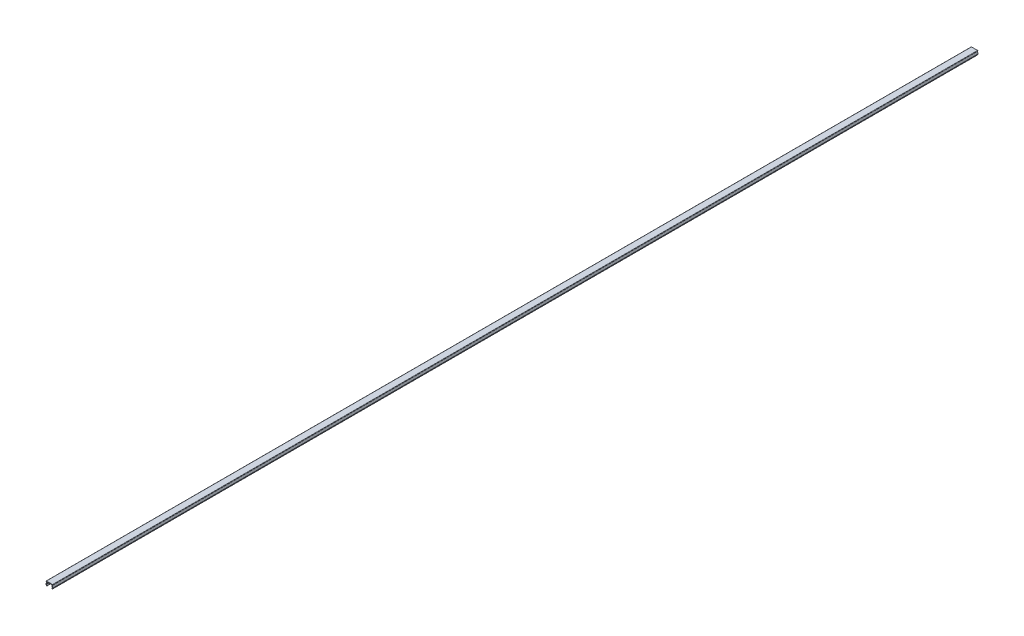
ISO-10303-21;
HEADER;
FILE_DESCRIPTION(('STEP AP214'),'2;1');
FILE_NAME('part.step','',(''),(''),'','','');
FILE_SCHEMA(('AUTOMOTIVE_DESIGN { 1 0 10303 214 1 1 1 1 }'));
ENDSEC;
DATA;
#1=APPLICATION_CONTEXT('core data for automotive mechanical design processes');
#2=APPLICATION_PROTOCOL_DEFINITION('international standard','automotive_design',2000,#1);
#3=PRODUCT_CONTEXT('',#1,'mechanical');
#4=PRODUCT('Part','Part','',(#3));
#5=PRODUCT_RELATED_PRODUCT_CATEGORY('part','',(#4));
#6=PRODUCT_DEFINITION_FORMATION('','',#4);
#7=PRODUCT_DEFINITION_CONTEXT('part definition',#1,'design');
#8=PRODUCT_DEFINITION('design','',#6,#7);
#9=PRODUCT_DEFINITION_SHAPE('','',#8);
#10=(LENGTH_UNIT() NAMED_UNIT(*) SI_UNIT(.MILLI.,.METRE.));
#11=(NAMED_UNIT(*) PLANE_ANGLE_UNIT() SI_UNIT($,.RADIAN.));
#12=(NAMED_UNIT(*) SI_UNIT($,.STERADIAN.) SOLID_ANGLE_UNIT());
#13=UNCERTAINTY_MEASURE_WITH_UNIT(LENGTH_MEASURE(1.E-05),#10,'distance_accuracy_value','');
#14=(GEOMETRIC_REPRESENTATION_CONTEXT(3) GLOBAL_UNCERTAINTY_ASSIGNED_CONTEXT((#13)) GLOBAL_UNIT_ASSIGNED_CONTEXT((#10,
#11,#12)) REPRESENTATION_CONTEXT('',''));
#15=CARTESIAN_POINT('',(0.,0.,0.));
#16=DIRECTION('',(0.,0.,1.));
#17=DIRECTION('',(1.,0.,0.));
#18=AXIS2_PLACEMENT_3D('',#15,#16,#17);
#19=CARTESIAN_POINT('',(-1.32833862518597,3.94999984480356,1000.));
#20=DIRECTION('',(0.,1.,0.));
#21=DIRECTION('',(0.,0.,1.));
#22=AXIS2_PLACEMENT_3D('',#19,#20,#21);
#23=PLANE('',#22);
#24=DIRECTION('',(0.,0.,-1.));
#25=VECTOR('',#24,1.);
#26=CARTESIAN_POINT('',(4.82913663774382,3.94999984480356,1000.));
#27=LINE('',#26,#25);
#28=CARTESIAN_POINT('',(4.82913663774382,3.94999984480356,1000.));
#29=VERTEX_POINT('',#28);
#30=CARTESIAN_POINT('',(4.82913663774382,3.94999984480356,0.));
#31=VERTEX_POINT('',#30);
#32=EDGE_CURVE('E162',#29,#31,#27,.T.);
#33=ORIENTED_EDGE('',*,*,#32,.F.);
#34=DIRECTION('',(1.,0.,0.));
#35=VECTOR('',#34,1.);
#36=CARTESIAN_POINT('',(-1.32833862518597,3.94999984480356,1000.));
#37=LINE('',#36,#35);
#38=CARTESIAN_POINT('',(-0.285813888115763,3.94999984480356,1000.));
#39=VERTEX_POINT('',#38);
#40=EDGE_CURVE('E232',#39,#29,#37,.T.);
#41=ORIENTED_EDGE('',*,*,#40,.F.);
#42=DIRECTION('',(0.,0.,-1.));
#43=VECTOR('',#42,1.);
#44=CARTESIAN_POINT('',(-0.285813888115763,3.94999984480356,1000.));
#45=LINE('',#44,#43);
#46=CARTESIAN_POINT('',(-0.285813888115763,3.94999984480356,0.));
#47=VERTEX_POINT('',#46);
#48=EDGE_CURVE('E245',#39,#47,#45,.T.);
#49=ORIENTED_EDGE('',*,*,#48,.T.);
#50=DIRECTION('',(1.,0.,0.));
#51=VECTOR('',#50,1.);
#52=CARTESIAN_POINT('',(-1.32833862518597,3.94999984480356,0.));
#53=LINE('',#52,#51);
#54=EDGE_CURVE('E240',#47,#31,#53,.T.);
#55=ORIENTED_EDGE('',*,*,#54,.T.);
#56=EDGE_LOOP('',(#33,#41,#49,#55));
#57=FACE_BOUND('',#56,.T.);
#58=ADVANCED_FACE('F16',(#57),#23,.F.);
#59=CARTESIAN_POINT('',(-1.02833862518597,3.94999984480356,1000.));
#60=VERTEX_POINT('',#59);
#61=CARTESIAN_POINT('',(-0.899434790827606,3.94999984480356,1000.));
#62=VERTEX_POINT('',#61);
#63=EDGE_CURVE('E229',#60,#62,#37,.T.);
#64=ORIENTED_EDGE('',*,*,#63,.F.);
#65=DIRECTION('',(0.,0.,-1.));
#66=VECTOR('',#65,1.);
#67=CARTESIAN_POINT('',(-1.02833862518597,3.94999984480356,0.));
#68=LINE('',#67,#66);
#69=CARTESIAN_POINT('',(-1.02833862518597,3.94999984480356,0.));
#70=VERTEX_POINT('',#69);
#71=EDGE_CURVE('E25',#60,#70,#68,.T.);
#72=ORIENTED_EDGE('',*,*,#71,.T.);
#73=CARTESIAN_POINT('',(-0.899434790827606,3.94999984480356,0.));
#74=VERTEX_POINT('',#73);
#75=EDGE_CURVE('E237',#70,#74,#53,.T.);
#76=ORIENTED_EDGE('',*,*,#75,.T.);
#77=DIRECTION('',(0.,0.,-1.));
#78=VECTOR('',#77,1.);
#79=CARTESIAN_POINT('',(-0.899434790827606,3.94999984480356,1000.));
#80=LINE('',#79,#78);
#81=EDGE_CURVE('E236',#62,#74,#80,.T.);
#82=ORIENTED_EDGE('',*,*,#81,.F.);
#83=EDGE_LOOP('',(#64,#72,#76,#82));
#84=FACE_BOUND('',#83,.T.);
#85=ADVANCED_FACE('F318',(#84),#23,.F.);
#86=CARTESIAN_POINT('',(5.44275754045566,3.94999984480356,0.));
#87=VERTEX_POINT('',#86);
#88=CARTESIAN_POINT('',(5.57166137481403,3.94999984480356,0.));
#89=VERTEX_POINT('',#88);
#90=EDGE_CURVE('E228',#87,#89,#53,.T.);
#91=ORIENTED_EDGE('',*,*,#90,.T.);
#92=DIRECTION('',(0.,0.,-1.));
#93=VECTOR('',#92,1.);
#94=CARTESIAN_POINT('',(5.57166137481403,3.94999984480356,1000.));
#95=LINE('',#94,#93);
#96=CARTESIAN_POINT('',(5.57166137481403,3.94999984480356,1000.));
#97=VERTEX_POINT('',#96);
#98=EDGE_CURVE('E10',#89,#97,#95,.F.);
#99=ORIENTED_EDGE('',*,*,#98,.T.);
#100=CARTESIAN_POINT('',(5.44275754045566,3.94999984480356,1000.));
#101=VERTEX_POINT('',#100);
#102=EDGE_CURVE('E233',#101,#97,#37,.T.);
#103=ORIENTED_EDGE('',*,*,#102,.F.);
#104=DIRECTION('',(0.,0.,-1.));
#105=VECTOR('',#104,1.);
#106=CARTESIAN_POINT('',(5.44275754045567,3.94999984480356,1000.));
#107=LINE('',#106,#105);
#108=EDGE_CURVE('E191',#101,#87,#107,.T.);
#109=ORIENTED_EDGE('',*,*,#108,.T.);
#110=EDGE_LOOP('',(#91,#99,#103,#109));
#111=FACE_BOUND('',#110,.T.);
#112=ADVANCED_FACE('F287',(#111),#23,.F.);
#113=CARTESIAN_POINT('',(-1.32833862518597,4.54999984480356,1000.));
#114=DIRECTION('',(0.,1.,0.));
#115=DIRECTION('',(0.,0.,1.));
#116=AXIS2_PLACEMENT_3D('',#113,#114,#115);
#117=PLANE('',#116);
#118=DIRECTION('',(1.,0.,0.));
#119=VECTOR('',#118,1.);
#120=CARTESIAN_POINT('',(-1.32833862518597,4.54999984480356,0.));
#121=LINE('',#120,#119);
#122=CARTESIAN_POINT('',(-1.02833862518597,4.54999984480356,0.));
#123=VERTEX_POINT('',#122);
#124=CARTESIAN_POINT('',(5.57166137481403,4.54999984480356,0.));
#125=VERTEX_POINT('',#124);
#126=EDGE_CURVE('E239',#123,#125,#121,.T.);
#127=ORIENTED_EDGE('',*,*,#126,.F.);
#128=DIRECTION('',(0.,0.,-1.));
#129=VECTOR('',#128,1.);
#130=CARTESIAN_POINT('',(-1.02833862518597,4.54999984480356,1000.));
#131=LINE('',#130,#129);
#132=CARTESIAN_POINT('',(-1.02833862518597,4.54999984480356,1000.));
#133=VERTEX_POINT('',#132);
#134=EDGE_CURVE('E258',#123,#133,#131,.F.);
#135=ORIENTED_EDGE('',*,*,#134,.T.);
#136=DIRECTION('',(1.,0.,0.));
#137=VECTOR('',#136,1.);
#138=CARTESIAN_POINT('',(-1.32833862518597,4.54999984480356,1000.));
#139=LINE('',#138,#137);
#140=CARTESIAN_POINT('',(5.57166137481403,4.54999984480356,1000.));
#141=VERTEX_POINT('',#140);
#142=EDGE_CURVE('E231',#133,#141,#139,.T.);
#143=ORIENTED_EDGE('',*,*,#142,.T.);
#144=DIRECTION('',(0.,0.,-1.));
#145=VECTOR('',#144,1.);
#146=CARTESIAN_POINT('',(5.57166137481403,4.54999984480356,1000.));
#147=LINE('',#146,#145);
#148=EDGE_CURVE('E255',#141,#125,#147,.T.);
#149=ORIENTED_EDGE('',*,*,#148,.T.);
#150=EDGE_LOOP('',(#127,#135,#143,#149));
#151=FACE_BOUND('',#150,.T.);
#152=ADVANCED_FACE('F327',(#151),#117,.T.);
#153=CARTESIAN_POINT('',(0.,0.,1000.));
#154=DIRECTION('',(0.,0.,-1.));
#155=DIRECTION('',(-1.,0.,0.));
#156=AXIS2_PLACEMENT_3D('',#153,#154,#155);
#157=PLANE('',#156);
#158=ORIENTED_EDGE('',*,*,#142,.F.);
#159=CARTESIAN_POINT('',(-1.02833862518597,4.24999984480356,1000.));
#160=DIRECTION('',(0.,0.,-1.));
#161=DIRECTION('',(-1.,0.,0.));
#162=AXIS2_PLACEMENT_3D('',#159,#160,#161);
#163=CIRCLE('',#162,0.3);
#164=CARTESIAN_POINT('',(-1.32833862518597,4.24999984480356,1000.));
#165=VERTEX_POINT('',#164);
#166=EDGE_CURVE('E38',#133,#165,#163,.F.);
#167=ORIENTED_EDGE('',*,*,#166,.T.);
#168=CARTESIAN_POINT('',(-1.02833862518597,4.24999984480356,1000.));
#169=DIRECTION('',(0.,0.,-1.));
#170=DIRECTION('',(-1.,0.,0.));
#171=AXIS2_PLACEMENT_3D('',#168,#169,#170);
#172=CIRCLE('',#171,0.3);
#173=EDGE_CURVE('E33',#165,#60,#172,.F.);
#174=ORIENTED_EDGE('',*,*,#173,.T.);
#175=ORIENTED_EDGE('',*,*,#63,.T.);
#176=DIRECTION('',(-0.209529088730873,-0.97780241407741,0.));
#177=VECTOR('',#176,1.);
#178=CARTESIAN_POINT('',(-0.821679349409193,4.31285857142282,1000.));
#179=LINE('',#178,#177);
#180=CARTESIAN_POINT('',(-1.44301852608376,1.4132757469415,1000.));
#181=VERTEX_POINT('',#180);
#182=EDGE_CURVE('E205',#62,#181,#179,.T.);
#183=ORIENTED_EDGE('',*,*,#182,.T.);
#184=DIRECTION('',(0.429056814568288,-0.90327750435429,0.));
#185=VECTOR('',#184,1.);
#186=CARTESIAN_POINT('',(-1.39932187649226,1.32128280043307,1000.));
#187=LINE('',#186,#185);
#188=CARTESIAN_POINT('',(-0.829321876492257,0.121282800433072,1000.));
#189=VERTEX_POINT('',#188);
#190=EDGE_CURVE('E194',#181,#189,#187,.T.);
#191=ORIENTED_EDGE('',*,*,#190,.T.);
#192=DIRECTION('',(-0.90327750435429,-0.429056814568287,0.));
#193=VECTOR('',#192,1.);
#194=CARTESIAN_POINT('',(-0.287355373879683,0.378716889174045,1000.));
#195=LINE('',#194,#193);
#196=CARTESIAN_POINT('',(-0.287355373879683,0.378716889174045,1000.));
#197=VERTEX_POINT('',#196);
#198=EDGE_CURVE('E196',#197,#189,#195,.T.);
#199=ORIENTED_EDGE('',*,*,#198,.F.);
#200=DIRECTION('',(0.429056814568288,-0.90327750435429,0.));
#201=VECTOR('',#200,1.);
#202=CARTESIAN_POINT('',(-0.857355373879683,1.57871688917404,1000.));
#203=LINE('',#202,#201);
#204=CARTESIAN_POINT('',(-0.813658724288179,1.48672394266561,1000.));
#205=VERTEX_POINT('',#204);
#206=EDGE_CURVE('E200',#205,#197,#203,.T.);
#207=ORIENTED_EDGE('',*,*,#206,.F.);
#208=DIRECTION('',(-0.209529088730873,-0.97780241407741,0.));
#209=VECTOR('',#208,1.);
#210=CARTESIAN_POINT('',(-0.234997900962748,4.1871411181843,1000.));
#211=LINE('',#210,#209);
#212=EDGE_CURVE('E203',#39,#205,#211,.T.);
#213=ORIENTED_EDGE('',*,*,#212,.F.);
#214=ORIENTED_EDGE('',*,*,#40,.T.);
#215=DIRECTION('',(0.209529088730874,-0.97780241407741,0.));
#216=VECTOR('',#215,1.);
#217=CARTESIAN_POINT('',(4.77832065059081,4.1871411181843,1000.));
#218=LINE('',#217,#216);
#219=CARTESIAN_POINT('',(5.35698147391624,1.48672394266562,1000.));
#220=VERTEX_POINT('',#219);
#221=EDGE_CURVE('E148',#29,#220,#218,.T.);
#222=ORIENTED_EDGE('',*,*,#221,.T.);
#223=DIRECTION('',(-0.429056814568288,-0.90327750435429,0.));
#224=VECTOR('',#223,1.);
#225=CARTESIAN_POINT('',(5.40067812350774,1.57871688917405,1000.));
#226=LINE('',#225,#224);
#227=CARTESIAN_POINT('',(4.83067812350774,0.378716889174045,1000.));
#228=VERTEX_POINT('',#227);
#229=EDGE_CURVE('E139',#220,#228,#226,.T.);
#230=ORIENTED_EDGE('',*,*,#229,.T.);
#231=DIRECTION('',(-0.90327750435429,0.429056814568287,0.));
#232=VECTOR('',#231,1.);
#233=CARTESIAN_POINT('',(5.37264462612032,0.121282800433073,1000.));
#234=LINE('',#233,#232);
#235=CARTESIAN_POINT('',(5.37264462612032,0.121282800433073,1000.));
#236=VERTEX_POINT('',#235);
#237=EDGE_CURVE('E144',#236,#228,#234,.T.);
#238=ORIENTED_EDGE('',*,*,#237,.F.);
#239=DIRECTION('',(-0.429056814568288,-0.90327750435429,0.));
#240=VECTOR('',#239,1.);
#241=CARTESIAN_POINT('',(5.94264462612032,1.32128280043307,1000.));
#242=LINE('',#241,#240);
#243=CARTESIAN_POINT('',(5.98634127571182,1.4132757469415,1000.));
#244=VERTEX_POINT('',#243);
#245=EDGE_CURVE('E166',#244,#236,#242,.T.);
#246=ORIENTED_EDGE('',*,*,#245,.F.);
#247=DIRECTION('',(0.209529088730874,-0.97780241407741,0.));
#248=VECTOR('',#247,1.);
#249=CARTESIAN_POINT('',(5.36500209903725,4.31285857142282,1000.));
#250=LINE('',#249,#248);
#251=EDGE_CURVE('E168',#101,#244,#250,.T.);
#252=ORIENTED_EDGE('',*,*,#251,.F.);
#253=ORIENTED_EDGE('',*,*,#102,.T.);
#254=CARTESIAN_POINT('',(5.57166137481403,4.24999984480356,1000.));
#255=DIRECTION('',(0.,0.,-1.));
#256=DIRECTION('',(-1.,0.,0.));
#257=AXIS2_PLACEMENT_3D('',#254,#255,#256);
#258=CIRCLE('',#257,0.3);
#259=CARTESIAN_POINT('',(5.87166137481403,4.24999984480356,1000.));
#260=VERTEX_POINT('',#259);
#261=EDGE_CURVE('E261',#97,#260,#258,.F.);
#262=ORIENTED_EDGE('',*,*,#261,.T.);
#263=CARTESIAN_POINT('',(5.57166137481403,4.24999984480356,1000.));
#264=DIRECTION('',(0.,0.,-1.));
#265=DIRECTION('',(-1.,0.,0.));
#266=AXIS2_PLACEMENT_3D('',#263,#264,#265);
#267=CIRCLE('',#266,0.3);
#268=EDGE_CURVE('E263',#260,#141,#267,.F.);
#269=ORIENTED_EDGE('',*,*,#268,.T.);
#270=EDGE_LOOP('',(#158,#167,#174,#175,#183,#191,#199,#207,#213,#214,#222,#230,#238,#246,#252,
#253,#262,#269));
#271=FACE_BOUND('',#270,.T.);
#272=ADVANCED_FACE('F141',(#271),#157,.F.);
#273=CARTESIAN_POINT('',(0.,0.,0.));
#274=DIRECTION('',(0.,0.,-1.));
#275=DIRECTION('',(-1.,0.,0.));
#276=AXIS2_PLACEMENT_3D('',#273,#274,#275);
#277=PLANE('',#276);
#278=CARTESIAN_POINT('',(-1.02833862518597,4.24999984480356,0.));
#279=DIRECTION('',(0.,0.,-1.));
#280=DIRECTION('',(-1.,0.,0.));
#281=AXIS2_PLACEMENT_3D('',#278,#279,#280);
#282=CIRCLE('',#281,0.3);
#283=CARTESIAN_POINT('',(-1.32833862518597,4.24999984480356,0.));
#284=VERTEX_POINT('',#283);
#285=EDGE_CURVE('E251',#70,#284,#282,.T.);
#286=ORIENTED_EDGE('',*,*,#285,.T.);
#287=CARTESIAN_POINT('',(-1.02833862518597,4.24999984480356,0.));
#288=DIRECTION('',(0.,0.,-1.));
#289=DIRECTION('',(-1.,0.,0.));
#290=AXIS2_PLACEMENT_3D('',#287,#288,#289);
#291=CIRCLE('',#290,0.3);
#292=EDGE_CURVE('E253',#284,#123,#291,.T.);
#293=ORIENTED_EDGE('',*,*,#292,.T.);
#294=ORIENTED_EDGE('',*,*,#126,.T.);
#295=CARTESIAN_POINT('',(5.57166137481403,4.24999984480356,0.));
#296=DIRECTION('',(0.,0.,-1.));
#297=DIRECTION('',(-1.,0.,0.));
#298=AXIS2_PLACEMENT_3D('',#295,#296,#297);
#299=CIRCLE('',#298,0.3);
#300=CARTESIAN_POINT('',(5.87166137481403,4.24999984480356,0.));
#301=VERTEX_POINT('',#300);
#302=EDGE_CURVE('E249',#125,#301,#299,.T.);
#303=ORIENTED_EDGE('',*,*,#302,.T.);
#304=CARTESIAN_POINT('',(5.57166137481403,4.24999984480356,0.));
#305=DIRECTION('',(0.,0.,-1.));
#306=DIRECTION('',(-1.,0.,0.));
#307=AXIS2_PLACEMENT_3D('',#304,#305,#306);
#308=CIRCLE('',#307,0.3);
#309=EDGE_CURVE('E247',#301,#89,#308,.T.);
#310=ORIENTED_EDGE('',*,*,#309,.T.);
#311=ORIENTED_EDGE('',*,*,#90,.F.);
#312=DIRECTION('',(0.209529088730874,-0.97780241407741,0.));
#313=VECTOR('',#312,1.);
#314=CARTESIAN_POINT('',(5.36500209903725,4.31285857142282,0.));
#315=LINE('',#314,#313);
#316=CARTESIAN_POINT('',(5.98634127571182,1.4132757469415,0.));
#317=VERTEX_POINT('',#316);
#318=EDGE_CURVE('E181',#87,#317,#315,.T.);
#319=ORIENTED_EDGE('',*,*,#318,.T.);
#320=DIRECTION('',(-0.429056814568288,-0.90327750435429,0.));
#321=VECTOR('',#320,1.);
#322=CARTESIAN_POINT('',(5.94264462612032,1.32128280043307,0.));
#323=LINE('',#322,#321);
#324=CARTESIAN_POINT('',(5.37264462612032,0.121282800433073,0.));
#325=VERTEX_POINT('',#324);
#326=EDGE_CURVE('E178',#317,#325,#323,.T.);
#327=ORIENTED_EDGE('',*,*,#326,.T.);
#328=DIRECTION('',(-0.90327750435429,0.429056814568287,0.));
#329=VECTOR('',#328,1.);
#330=CARTESIAN_POINT('',(5.37264462612032,0.121282800433073,0.));
#331=LINE('',#330,#329);
#332=CARTESIAN_POINT('',(4.83067812350774,0.378716889174045,0.));
#333=VERTEX_POINT('',#332);
#334=EDGE_CURVE('E175',#325,#333,#331,.T.);
#335=ORIENTED_EDGE('',*,*,#334,.T.);
#336=DIRECTION('',(-0.429056814568288,-0.90327750435429,0.));
#337=VECTOR('',#336,1.);
#338=CARTESIAN_POINT('',(5.40067812350774,1.57871688917405,0.));
#339=LINE('',#338,#337);
#340=CARTESIAN_POINT('',(5.35698147391624,1.48672394266562,0.));
#341=VERTEX_POINT('',#340);
#342=EDGE_CURVE('E158',#341,#333,#339,.T.);
#343=ORIENTED_EDGE('',*,*,#342,.F.);
#344=DIRECTION('',(0.209529088730874,-0.97780241407741,0.));
#345=VECTOR('',#344,1.);
#346=CARTESIAN_POINT('',(4.77832065059081,4.1871411181843,0.));
#347=LINE('',#346,#345);
#348=EDGE_CURVE('E152',#31,#341,#347,.T.);
#349=ORIENTED_EDGE('',*,*,#348,.F.);
#350=ORIENTED_EDGE('',*,*,#54,.F.);
#351=DIRECTION('',(-0.209529088730873,-0.97780241407741,0.));
#352=VECTOR('',#351,1.);
#353=CARTESIAN_POINT('',(-0.234997900962748,4.1871411181843,0.));
#354=LINE('',#353,#352);
#355=CARTESIAN_POINT('',(-0.813658724288179,1.48672394266561,0.));
#356=VERTEX_POINT('',#355);
#357=EDGE_CURVE('E216',#47,#356,#354,.T.);
#358=ORIENTED_EDGE('',*,*,#357,.T.);
#359=DIRECTION('',(0.429056814568288,-0.90327750435429,0.));
#360=VECTOR('',#359,1.);
#361=CARTESIAN_POINT('',(-0.857355373879683,1.57871688917404,0.));
#362=LINE('',#361,#360);
#363=CARTESIAN_POINT('',(-0.287355373879683,0.378716889174045,0.));
#364=VERTEX_POINT('',#363);
#365=EDGE_CURVE('E213',#356,#364,#362,.T.);
#366=ORIENTED_EDGE('',*,*,#365,.T.);
#367=DIRECTION('',(-0.90327750435429,-0.429056814568287,0.));
#368=VECTOR('',#367,1.);
#369=CARTESIAN_POINT('',(-0.287355373879683,0.378716889174045,0.));
#370=LINE('',#369,#368);
#371=CARTESIAN_POINT('',(-0.829321876492257,0.121282800433072,0.));
#372=VERTEX_POINT('',#371);
#373=EDGE_CURVE('E210',#364,#372,#370,.T.);
#374=ORIENTED_EDGE('',*,*,#373,.T.);
#375=DIRECTION('',(0.429056814568288,-0.90327750435429,0.));
#376=VECTOR('',#375,1.);
#377=CARTESIAN_POINT('',(-1.39932187649226,1.32128280043307,0.));
#378=LINE('',#377,#376);
#379=CARTESIAN_POINT('',(-1.44301852608376,1.4132757469415,0.));
#380=VERTEX_POINT('',#379);
#381=EDGE_CURVE('E193',#380,#372,#378,.T.);
#382=ORIENTED_EDGE('',*,*,#381,.F.);
#383=DIRECTION('',(-0.209529088730873,-0.97780241407741,0.));
#384=VECTOR('',#383,1.);
#385=CARTESIAN_POINT('',(-0.821679349409193,4.31285857142282,0.));
#386=LINE('',#385,#384);
#387=EDGE_CURVE('E197',#74,#380,#386,.T.);
#388=ORIENTED_EDGE('',*,*,#387,.F.);
#389=ORIENTED_EDGE('',*,*,#75,.F.);
#390=EDGE_LOOP('',(#286,#293,#294,#303,#310,#311,#319,#327,#335,#343,#349,#350,#358,#366,#374,
#382,#388,#389));
#391=FACE_BOUND('',#390,.T.);
#392=ADVANCED_FACE('F284',(#391),#277,.T.);
#393=CARTESIAN_POINT('',(-0.234997900962748,4.1871411181843,1000.));
#394=DIRECTION('',(0.97780241407741,-0.209529088730873,0.));
#395=DIRECTION('',(0.209529088730873,0.97780241407741,0.));
#396=AXIS2_PLACEMENT_3D('',#393,#394,#395);
#397=PLANE('',#396);
#398=ORIENTED_EDGE('',*,*,#48,.F.);
#399=ORIENTED_EDGE('',*,*,#212,.T.);
#400=DIRECTION('',(0.,0.,-1.));
#401=VECTOR('',#400,1.);
#402=CARTESIAN_POINT('',(-0.813658724288179,1.48672394266561,1000.));
#403=LINE('',#402,#401);
#404=EDGE_CURVE('E221',#205,#356,#403,.T.);
#405=ORIENTED_EDGE('',*,*,#404,.T.);
#406=ORIENTED_EDGE('',*,*,#357,.F.);
#407=EDGE_LOOP('',(#398,#399,#405,#406));
#408=FACE_BOUND('',#407,.T.);
#409=ADVANCED_FACE('F339',(#408),#397,.T.);
#410=CARTESIAN_POINT('',(-0.821679349409193,4.31285857142282,1000.));
#411=DIRECTION('',(0.97780241407741,-0.209529088730873,0.));
#412=DIRECTION('',(0.209529088730873,0.97780241407741,0.));
#413=AXIS2_PLACEMENT_3D('',#410,#411,#412);
#414=PLANE('',#413);
#415=ORIENTED_EDGE('',*,*,#182,.F.);
#416=ORIENTED_EDGE('',*,*,#81,.T.);
#417=ORIENTED_EDGE('',*,*,#387,.T.);
#418=DIRECTION('',(0.,0.,-1.));
#419=VECTOR('',#418,1.);
#420=CARTESIAN_POINT('',(-1.44301852608376,1.4132757469415,1000.));
#421=LINE('',#420,#419);
#422=EDGE_CURVE('E207',#181,#380,#421,.T.);
#423=ORIENTED_EDGE('',*,*,#422,.F.);
#424=EDGE_LOOP('',(#415,#416,#417,#423));
#425=FACE_BOUND('',#424,.T.);
#426=ADVANCED_FACE('F344',(#425),#414,.F.);
#427=CARTESIAN_POINT('',(-1.39932187649226,1.32128280043307,1000.));
#428=DIRECTION('',(0.90327750435429,0.429056814568288,0.));
#429=DIRECTION('',(-0.429056814568288,0.90327750435429,0.));
#430=AXIS2_PLACEMENT_3D('',#427,#428,#429);
#431=PLANE('',#430);
#432=ORIENTED_EDGE('',*,*,#381,.T.);
#433=DIRECTION('',(0.,0.,-1.));
#434=VECTOR('',#433,1.);
#435=CARTESIAN_POINT('',(-0.829321876492257,0.121282800433072,1000.));
#436=LINE('',#435,#434);
#437=EDGE_CURVE('E226',#189,#372,#436,.T.);
#438=ORIENTED_EDGE('',*,*,#437,.F.);
#439=ORIENTED_EDGE('',*,*,#190,.F.);
#440=ORIENTED_EDGE('',*,*,#422,.T.);
#441=EDGE_LOOP('',(#432,#438,#439,#440));
#442=FACE_BOUND('',#441,.T.);
#443=ADVANCED_FACE('F341',(#442),#431,.F.);
#444=CARTESIAN_POINT('',(-0.287355373879683,0.378716889174045,1000.));
#445=DIRECTION('',(0.429056814568288,-0.90327750435429,0.));
#446=DIRECTION('',(0.90327750435429,0.429056814568287,0.));
#447=AXIS2_PLACEMENT_3D('',#444,#445,#446);
#448=PLANE('',#447);
#449=ORIENTED_EDGE('',*,*,#373,.F.);
#450=DIRECTION('',(0.,0.,-1.));
#451=VECTOR('',#450,1.);
#452=CARTESIAN_POINT('',(-0.287355373879683,0.378716889174045,1000.));
#453=LINE('',#452,#451);
#454=EDGE_CURVE('E224',#197,#364,#453,.T.);
#455=ORIENTED_EDGE('',*,*,#454,.F.);
#456=ORIENTED_EDGE('',*,*,#198,.T.);
#457=ORIENTED_EDGE('',*,*,#437,.T.);
#458=EDGE_LOOP('',(#449,#455,#456,#457));
#459=FACE_BOUND('',#458,.T.);
#460=ADVANCED_FACE('F313',(#459),#448,.T.);
#461=CARTESIAN_POINT('',(-0.857355373879683,1.57871688917404,1000.));
#462=DIRECTION('',(0.90327750435429,0.429056814568288,0.));
#463=DIRECTION('',(-0.429056814568288,0.90327750435429,0.));
#464=AXIS2_PLACEMENT_3D('',#461,#462,#463);
#465=PLANE('',#464);
#466=ORIENTED_EDGE('',*,*,#365,.F.);
#467=ORIENTED_EDGE('',*,*,#404,.F.);
#468=ORIENTED_EDGE('',*,*,#206,.T.);
#469=ORIENTED_EDGE('',*,*,#454,.T.);
#470=EDGE_LOOP('',(#466,#467,#468,#469));
#471=FACE_BOUND('',#470,.T.);
#472=ADVANCED_FACE('F305',(#471),#465,.T.);
#473=CARTESIAN_POINT('',(5.36500209903725,4.31285857142282,1000.));
#474=DIRECTION('',(0.97780241407741,0.209529088730874,0.));
#475=DIRECTION('',(-0.209529088730874,0.97780241407741,0.));
#476=AXIS2_PLACEMENT_3D('',#473,#474,#475);
#477=PLANE('',#476);
#478=ORIENTED_EDGE('',*,*,#108,.F.);
#479=ORIENTED_EDGE('',*,*,#251,.T.);
#480=DIRECTION('',(0.,0.,-1.));
#481=VECTOR('',#480,1.);
#482=CARTESIAN_POINT('',(5.98634127571182,1.4132757469415,1000.));
#483=LINE('',#482,#481);
#484=EDGE_CURVE('E185',#244,#317,#483,.T.);
#485=ORIENTED_EDGE('',*,*,#484,.T.);
#486=ORIENTED_EDGE('',*,*,#318,.F.);
#487=EDGE_LOOP('',(#478,#479,#485,#486));
#488=FACE_BOUND('',#487,.T.);
#489=ADVANCED_FACE('F303',(#488),#477,.T.);
#490=CARTESIAN_POINT('',(4.77832065059081,4.1871411181843,1000.));
#491=DIRECTION('',(0.97780241407741,0.209529088730874,0.));
#492=DIRECTION('',(-0.209529088730874,0.97780241407741,0.));
#493=AXIS2_PLACEMENT_3D('',#490,#491,#492);
#494=PLANE('',#493);
#495=ORIENTED_EDGE('',*,*,#221,.F.);
#496=ORIENTED_EDGE('',*,*,#32,.T.);
#497=ORIENTED_EDGE('',*,*,#348,.T.);
#498=DIRECTION('',(0.,0.,-1.));
#499=VECTOR('',#498,1.);
#500=CARTESIAN_POINT('',(5.35698147391624,1.48672394266562,1000.));
#501=LINE('',#500,#499);
#502=EDGE_CURVE('E173',#220,#341,#501,.T.);
#503=ORIENTED_EDGE('',*,*,#502,.F.);
#504=EDGE_LOOP('',(#495,#496,#497,#503));
#505=FACE_BOUND('',#504,.T.);
#506=ADVANCED_FACE('F296',(#505),#494,.F.);
#507=CARTESIAN_POINT('',(5.40067812350774,1.57871688917405,1000.));
#508=DIRECTION('',(0.90327750435429,-0.429056814568288,0.));
#509=DIRECTION('',(0.429056814568288,0.90327750435429,0.));
#510=AXIS2_PLACEMENT_3D('',#507,#508,#509);
#511=PLANE('',#510);
#512=ORIENTED_EDGE('',*,*,#342,.T.);
#513=DIRECTION('',(0.,0.,-1.));
#514=VECTOR('',#513,1.);
#515=CARTESIAN_POINT('',(4.83067812350774,0.378716889174045,1000.));
#516=LINE('',#515,#514);
#517=EDGE_CURVE('E155',#228,#333,#516,.T.);
#518=ORIENTED_EDGE('',*,*,#517,.F.);
#519=ORIENTED_EDGE('',*,*,#229,.F.);
#520=ORIENTED_EDGE('',*,*,#502,.T.);
#521=EDGE_LOOP('',(#512,#518,#519,#520));
#522=FACE_BOUND('',#521,.T.);
#523=ADVANCED_FACE('F156',(#522),#511,.F.);
#524=CARTESIAN_POINT('',(5.37264462612032,0.121282800433073,1000.));
#525=DIRECTION('',(-0.429056814568287,-0.90327750435429,0.));
#526=DIRECTION('',(0.90327750435429,-0.429056814568287,0.));
#527=AXIS2_PLACEMENT_3D('',#524,#525,#526);
#528=PLANE('',#527);
#529=ORIENTED_EDGE('',*,*,#334,.F.);
#530=DIRECTION('',(0.,0.,-1.));
#531=VECTOR('',#530,1.);
#532=CARTESIAN_POINT('',(5.37264462612032,0.121282800433073,1000.));
#533=LINE('',#532,#531);
#534=EDGE_CURVE('E163',#236,#325,#533,.T.);
#535=ORIENTED_EDGE('',*,*,#534,.F.);
#536=ORIENTED_EDGE('',*,*,#237,.T.);
#537=ORIENTED_EDGE('',*,*,#517,.T.);
#538=EDGE_LOOP('',(#529,#535,#536,#537));
#539=FACE_BOUND('',#538,.T.);
#540=ADVANCED_FACE('F165',(#539),#528,.T.);
#541=CARTESIAN_POINT('',(5.94264462612032,1.32128280043307,1000.));
#542=DIRECTION('',(0.90327750435429,-0.429056814568288,0.));
#543=DIRECTION('',(0.429056814568288,0.90327750435429,0.));
#544=AXIS2_PLACEMENT_3D('',#541,#542,#543);
#545=PLANE('',#544);
#546=ORIENTED_EDGE('',*,*,#326,.F.);
#547=ORIENTED_EDGE('',*,*,#484,.F.);
#548=ORIENTED_EDGE('',*,*,#245,.T.);
#549=ORIENTED_EDGE('',*,*,#534,.T.);
#550=EDGE_LOOP('',(#546,#547,#548,#549));
#551=FACE_BOUND('',#550,.T.);
#552=ADVANCED_FACE('F300',(#551),#545,.T.);
#553=CARTESIAN_POINT('',(-1.02833862518597,4.24999984480356,1000.));
#554=DIRECTION('',(0.,0.,1.));
#555=DIRECTION('',(1.,0.,0.));
#556=AXIS2_PLACEMENT_3D('',#553,#554,#555);
#557=CYLINDRICAL_SURFACE('',#556,0.3);
#558=ORIENTED_EDGE('',*,*,#71,.F.);
#559=ORIENTED_EDGE('',*,*,#173,.F.);
#560=DIRECTION('',(0.,0.,-1.));
#561=VECTOR('',#560,1.);
#562=CARTESIAN_POINT('',(-1.32833862518597,4.24999984480356,1000.));
#563=LINE('',#562,#561);
#564=EDGE_CURVE('E176',#284,#165,#563,.F.);
#565=ORIENTED_EDGE('',*,*,#564,.F.);
#566=ORIENTED_EDGE('',*,*,#285,.F.);
#567=EDGE_LOOP('',(#558,#559,#565,#566));
#568=FACE_BOUND('',#567,.T.);
#569=ADVANCED_FACE('F359',(#568),#557,.T.);
#570=CARTESIAN_POINT('',(-1.02833862518597,4.24999984480356,1000.));
#571=DIRECTION('',(0.,0.,-1.));
#572=DIRECTION('',(-1.,0.,0.));
#573=AXIS2_PLACEMENT_3D('',#570,#571,#572);
#574=CYLINDRICAL_SURFACE('',#573,0.3);
#575=ORIENTED_EDGE('',*,*,#166,.F.);
#576=ORIENTED_EDGE('',*,*,#134,.F.);
#577=ORIENTED_EDGE('',*,*,#292,.F.);
#578=ORIENTED_EDGE('',*,*,#564,.T.);
#579=EDGE_LOOP('',(#575,#576,#577,#578));
#580=FACE_BOUND('',#579,.T.);
#581=ADVANCED_FACE('F363',(#580),#574,.T.);
#582=CARTESIAN_POINT('',(5.57166137481403,4.24999984480356,1000.));
#583=DIRECTION('',(0.,0.,1.));
#584=DIRECTION('',(1.,0.,0.));
#585=AXIS2_PLACEMENT_3D('',#582,#583,#584);
#586=CYLINDRICAL_SURFACE('',#585,0.3);
#587=DIRECTION('',(0.,0.,-1.));
#588=VECTOR('',#587,1.);
#589=CARTESIAN_POINT('',(5.87166137481403,4.24999984480356,0.));
#590=LINE('',#589,#588);
#591=EDGE_CURVE('E20',#260,#301,#590,.T.);
#592=ORIENTED_EDGE('',*,*,#591,.F.);
#593=ORIENTED_EDGE('',*,*,#261,.F.);
#594=ORIENTED_EDGE('',*,*,#98,.F.);
#595=ORIENTED_EDGE('',*,*,#309,.F.);
#596=EDGE_LOOP('',(#592,#593,#594,#595));
#597=FACE_BOUND('',#596,.T.);
#598=ADVANCED_FACE('F18',(#597),#586,.T.);
#599=CARTESIAN_POINT('',(5.57166137481403,4.24999984480356,1000.));
#600=DIRECTION('',(0.,0.,-1.));
#601=DIRECTION('',(-1.,0.,0.));
#602=AXIS2_PLACEMENT_3D('',#599,#600,#601);
#603=CYLINDRICAL_SURFACE('',#602,0.3);
#604=ORIENTED_EDGE('',*,*,#268,.F.);
#605=ORIENTED_EDGE('',*,*,#591,.T.);
#606=ORIENTED_EDGE('',*,*,#302,.F.);
#607=ORIENTED_EDGE('',*,*,#148,.F.);
#608=EDGE_LOOP('',(#604,#605,#606,#607));
#609=FACE_BOUND('',#608,.T.);
#610=ADVANCED_FACE('F275',(#609),#603,.T.);
#611=CLOSED_SHELL('',(#58,#85,#112,#152,#272,#392,#409,#426,#443,#460,#472,#489,#506,#523,#540,
#552,#569,#581,#598,#610));
#612=MANIFOLD_SOLID_BREP('B1',#611);
#613=ADVANCED_BREP_SHAPE_REPRESENTATION('',(#18,#612),#14);
#614=SHAPE_DEFINITION_REPRESENTATION(#9,#613);
ENDSEC;
END-ISO-10303-21;
